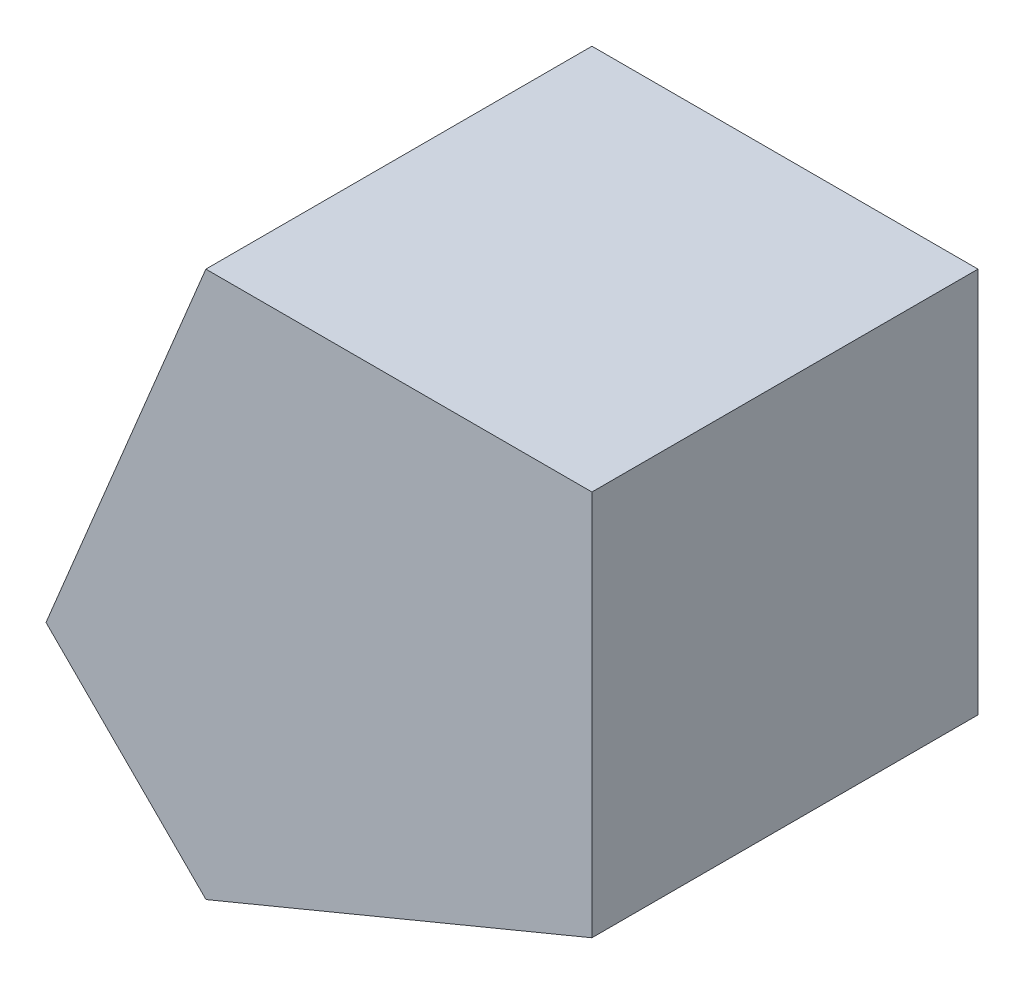
ISO-10303-21;
HEADER;
FILE_DESCRIPTION(('STEP AP214'),'2;1');
FILE_NAME('part.step','',(''),(''),'','','');
FILE_SCHEMA(('AUTOMOTIVE_DESIGN { 1 0 10303 214 1 1 1 1 }'));
ENDSEC;
DATA;
#1=APPLICATION_CONTEXT('core data for automotive mechanical design processes');
#2=APPLICATION_PROTOCOL_DEFINITION('international standard','automotive_design',2000,#1);
#3=PRODUCT_CONTEXT('',#1,'mechanical');
#4=PRODUCT('Part','Part','',(#3));
#5=PRODUCT_RELATED_PRODUCT_CATEGORY('part','',(#4));
#6=PRODUCT_DEFINITION_FORMATION('','',#4);
#7=PRODUCT_DEFINITION_CONTEXT('part definition',#1,'design');
#8=PRODUCT_DEFINITION('design','',#6,#7);
#9=PRODUCT_DEFINITION_SHAPE('','',#8);
#10=(LENGTH_UNIT() NAMED_UNIT(*) SI_UNIT(.MILLI.,.METRE.));
#11=(NAMED_UNIT(*) PLANE_ANGLE_UNIT() SI_UNIT($,.RADIAN.));
#12=(NAMED_UNIT(*) SI_UNIT($,.STERADIAN.) SOLID_ANGLE_UNIT());
#13=UNCERTAINTY_MEASURE_WITH_UNIT(LENGTH_MEASURE(1.E-05),#10,'distance_accuracy_value','');
#14=(GEOMETRIC_REPRESENTATION_CONTEXT(3) GLOBAL_UNCERTAINTY_ASSIGNED_CONTEXT((#13)) GLOBAL_UNIT_ASSIGNED_CONTEXT((#10,
#11,#12)) REPRESENTATION_CONTEXT('',''));
#15=CARTESIAN_POINT('',(0.,0.,0.));
#16=DIRECTION('',(0.,0.,1.));
#17=DIRECTION('',(1.,0.,0.));
#18=AXIS2_PLACEMENT_3D('',#15,#16,#17);
#19=CARTESIAN_POINT('',(6.62838598337919,2.10648875600251,10.));
#20=DIRECTION('',(-0.382683432365087,0.923879532511288,0.));
#21=DIRECTION('',(-0.923879532511288,-0.382683432365087,0.));
#22=AXIS2_PLACEMENT_3D('',#19,#20,#21);
#23=PLANE('',#22);
#24=DIRECTION('',(0.923879532511288,0.382683432365087,0.));
#25=VECTOR('',#24,1.);
#26=CARTESIAN_POINT('',(6.62838598337919,2.10648875600251,0.));
#27=LINE('',#26,#25);
#28=CARTESIAN_POINT('',(6.62838598337919,2.10648875600251,0.));
#29=VERTEX_POINT('',#28);
#30=CARTESIAN_POINT('',(16.6247625251513,6.24712349419276,0.));
#31=VERTEX_POINT('',#30);
#32=EDGE_CURVE('E109',#29,#31,#27,.T.);
#33=ORIENTED_EDGE('',*,*,#32,.T.);
#34=DIRECTION('',(0.,0.,-1.));
#35=VECTOR('',#34,1.);
#36=CARTESIAN_POINT('',(16.6247625251513,6.24712349419276,10.));
#37=LINE('',#36,#35);
#38=CARTESIAN_POINT('',(16.6247625251513,6.24712349419276,10.));
#39=VERTEX_POINT('',#38);
#40=EDGE_CURVE('E11',#39,#31,#37,.T.);
#41=ORIENTED_EDGE('',*,*,#40,.F.);
#42=DIRECTION('',(0.923879532511288,0.382683432365087,0.));
#43=VECTOR('',#42,1.);
#44=CARTESIAN_POINT('',(6.62838598337919,2.10648875600251,10.));
#45=LINE('',#44,#43);
#46=CARTESIAN_POINT('',(6.62838598337919,2.10648875600251,10.));
#47=VERTEX_POINT('',#46);
#48=EDGE_CURVE('E117',#47,#39,#45,.T.);
#49=ORIENTED_EDGE('',*,*,#48,.F.);
#50=DIRECTION('',(0.,0.,-1.));
#51=VECTOR('',#50,1.);
#52=CARTESIAN_POINT('',(6.62838598337919,2.10648875600251,10.));
#53=LINE('',#52,#51);
#54=EDGE_CURVE('E105',#47,#29,#53,.T.);
#55=ORIENTED_EDGE('',*,*,#54,.T.);
#56=EDGE_LOOP('',(#33,#41,#49,#55));
#57=FACE_BOUND('',#56,.T.);
#58=ADVANCED_FACE('F35',(#57),#23,.F.);
#59=CARTESIAN_POINT('',(16.6247625251513,6.24712349419276,10.));
#60=DIRECTION('',(-1.,0.,0.));
#61=DIRECTION('',(0.,0.,1.));
#62=AXIS2_PLACEMENT_3D('',#59,#60,#61);
#63=PLANE('',#62);
#64=DIRECTION('',(0.,1.,0.));
#65=VECTOR('',#64,1.);
#66=CARTESIAN_POINT('',(16.6247625251513,6.24712349419276,0.));
#67=LINE('',#66,#65);
#68=CARTESIAN_POINT('',(16.6247625251513,16.2471234941928,0.));
#69=VERTEX_POINT('',#68);
#70=EDGE_CURVE('E112',#31,#69,#67,.T.);
#71=ORIENTED_EDGE('',*,*,#70,.T.);
#72=DIRECTION('',(0.,0.,-1.));
#73=VECTOR('',#72,1.);
#74=CARTESIAN_POINT('',(16.6247625251513,16.2471234941928,10.));
#75=LINE('',#74,#73);
#76=CARTESIAN_POINT('',(16.6247625251513,16.2471234941928,10.));
#77=VERTEX_POINT('',#76);
#78=EDGE_CURVE('E43',#77,#69,#75,.T.);
#79=ORIENTED_EDGE('',*,*,#78,.F.);
#80=DIRECTION('',(0.,1.,0.));
#81=VECTOR('',#80,1.);
#82=CARTESIAN_POINT('',(16.6247625251513,6.24712349419276,10.));
#83=LINE('',#82,#81);
#84=EDGE_CURVE('E85',#39,#77,#83,.T.);
#85=ORIENTED_EDGE('',*,*,#84,.F.);
#86=ORIENTED_EDGE('',*,*,#40,.T.);
#87=EDGE_LOOP('',(#71,#79,#85,#86));
#88=FACE_BOUND('',#87,.T.);
#89=ADVANCED_FACE('F136',(#88),#63,.F.);
#90=CARTESIAN_POINT('',(16.6247625251513,16.2471234941928,10.));
#91=DIRECTION('',(0.,-1.,0.));
#92=DIRECTION('',(1.,0.,0.));
#93=AXIS2_PLACEMENT_3D('',#90,#91,#92);
#94=PLANE('',#93);
#95=DIRECTION('',(-1.,0.,0.));
#96=VECTOR('',#95,1.);
#97=CARTESIAN_POINT('',(16.6247625251513,16.2471234941928,0.));
#98=LINE('',#97,#96);
#99=CARTESIAN_POINT('',(6.62476252515132,16.2471234941928,0.));
#100=VERTEX_POINT('',#99);
#101=EDGE_CURVE('E100',#69,#100,#98,.T.);
#102=ORIENTED_EDGE('',*,*,#101,.T.);
#103=DIRECTION('',(0.,0.,-1.));
#104=VECTOR('',#103,1.);
#105=CARTESIAN_POINT('',(6.62476252515132,16.2471234941928,10.));
#106=LINE('',#105,#104);
#107=CARTESIAN_POINT('',(6.62476252515132,16.2471234941928,10.));
#108=VERTEX_POINT('',#107);
#109=EDGE_CURVE('E97',#108,#100,#106,.T.);
#110=ORIENTED_EDGE('',*,*,#109,.F.);
#111=DIRECTION('',(-1.,0.,0.));
#112=VECTOR('',#111,1.);
#113=CARTESIAN_POINT('',(16.6247625251513,16.2471234941928,10.));
#114=LINE('',#113,#112);
#115=EDGE_CURVE('E89',#77,#108,#114,.T.);
#116=ORIENTED_EDGE('',*,*,#115,.F.);
#117=ORIENTED_EDGE('',*,*,#78,.T.);
#118=EDGE_LOOP('',(#102,#110,#116,#117));
#119=FACE_BOUND('',#118,.T.);
#120=ADVANCED_FACE('F98',(#119),#94,.F.);
#121=CARTESIAN_POINT('',(6.62476252515132,16.2471234941928,10.));
#122=DIRECTION('',(0.923879532511289,-0.382683432365083,0.));
#123=DIRECTION('',(0.382683432365083,0.92387953251129,0.));
#124=AXIS2_PLACEMENT_3D('',#121,#122,#123);
#125=PLANE('',#124);
#126=DIRECTION('',(-0.382683432365083,-0.923879532511289,0.));
#127=VECTOR('',#126,1.);
#128=CARTESIAN_POINT('',(6.62476252515132,16.2471234941928,0.));
#129=LINE('',#128,#127);
#130=CARTESIAN_POINT('',(2.48412778696112,6.2507469524206,0.));
#131=VERTEX_POINT('',#130);
#132=EDGE_CURVE('E71',#100,#131,#129,.T.);
#133=ORIENTED_EDGE('',*,*,#132,.T.);
#134=DIRECTION('',(0.,0.,-1.));
#135=VECTOR('',#134,1.);
#136=CARTESIAN_POINT('',(2.48412778696112,6.2507469524206,10.));
#137=LINE('',#136,#135);
#138=CARTESIAN_POINT('',(2.48412778696112,6.2507469524206,10.));
#139=VERTEX_POINT('',#138);
#140=EDGE_CURVE('E101',#139,#131,#137,.T.);
#141=ORIENTED_EDGE('',*,*,#140,.F.);
#142=DIRECTION('',(-0.382683432365083,-0.923879532511289,0.));
#143=VECTOR('',#142,1.);
#144=CARTESIAN_POINT('',(6.62476252515132,16.2471234941928,10.));
#145=LINE('',#144,#143);
#146=EDGE_CURVE('E93',#108,#139,#145,.T.);
#147=ORIENTED_EDGE('',*,*,#146,.F.);
#148=ORIENTED_EDGE('',*,*,#109,.T.);
#149=EDGE_LOOP('',(#133,#141,#147,#148));
#150=FACE_BOUND('',#149,.T.);
#151=ADVANCED_FACE('F103',(#150),#125,.F.);
#152=CARTESIAN_POINT('',(6.62838598337919,2.10648875600251,10.));
#153=DIRECTION('',(0.707106781186549,0.707106781186546,0.));
#154=DIRECTION('',(-0.707106781186546,0.707106781186549,0.));
#155=AXIS2_PLACEMENT_3D('',#152,#153,#154);
#156=PLANE('',#155);
#157=DIRECTION('',(0.707106781186546,-0.707106781186549,0.));
#158=VECTOR('',#157,1.);
#159=CARTESIAN_POINT('',(6.62838598337919,2.10648875600251,0.));
#160=LINE('',#159,#158);
#161=EDGE_CURVE('E77',#131,#29,#160,.T.);
#162=ORIENTED_EDGE('',*,*,#161,.T.);
#163=ORIENTED_EDGE('',*,*,#54,.F.);
#164=DIRECTION('',(0.707106781186546,-0.707106781186549,0.));
#165=VECTOR('',#164,1.);
#166=CARTESIAN_POINT('',(6.62838598337919,2.10648875600251,10.));
#167=LINE('',#166,#165);
#168=EDGE_CURVE('E51',#139,#47,#167,.T.);
#169=ORIENTED_EDGE('',*,*,#168,.F.);
#170=ORIENTED_EDGE('',*,*,#140,.T.);
#171=EDGE_LOOP('',(#162,#163,#169,#170));
#172=FACE_BOUND('',#171,.T.);
#173=ADVANCED_FACE('F125',(#172),#156,.F.);
#174=CARTESIAN_POINT('',(0.,0.,10.));
#175=DIRECTION('',(0.,0.,1.));
#176=DIRECTION('',(1.,0.,0.));
#177=AXIS2_PLACEMENT_3D('',#174,#175,#176);
#178=PLANE('',#177);
#179=ORIENTED_EDGE('',*,*,#48,.T.);
#180=ORIENTED_EDGE('',*,*,#84,.T.);
#181=ORIENTED_EDGE('',*,*,#115,.T.);
#182=ORIENTED_EDGE('',*,*,#146,.T.);
#183=ORIENTED_EDGE('',*,*,#168,.T.);
#184=EDGE_LOOP('',(#179,#180,#181,#182,#183));
#185=FACE_BOUND('',#184,.T.);
#186=ADVANCED_FACE('F91',(#185),#178,.T.);
#187=CARTESIAN_POINT('',(0.,0.,0.));
#188=DIRECTION('',(0.,0.,1.));
#189=DIRECTION('',(1.,0.,0.));
#190=AXIS2_PLACEMENT_3D('',#187,#188,#189);
#191=PLANE('',#190);
#192=ORIENTED_EDGE('',*,*,#32,.F.);
#193=ORIENTED_EDGE('',*,*,#161,.F.);
#194=ORIENTED_EDGE('',*,*,#132,.F.);
#195=ORIENTED_EDGE('',*,*,#101,.F.);
#196=ORIENTED_EDGE('',*,*,#70,.F.);
#197=EDGE_LOOP('',(#192,#193,#194,#195,#196));
#198=FACE_BOUND('',#197,.T.);
#199=ADVANCED_FACE('F121',(#198),#191,.F.);
#200=CLOSED_SHELL('',(#58,#89,#120,#151,#173,#186,#199));
#201=MANIFOLD_SOLID_BREP('B2',#200);
#202=ADVANCED_BREP_SHAPE_REPRESENTATION('',(#18,#201),#14);
#203=SHAPE_DEFINITION_REPRESENTATION(#9,#202);
ENDSEC;
END-ISO-10303-21;
